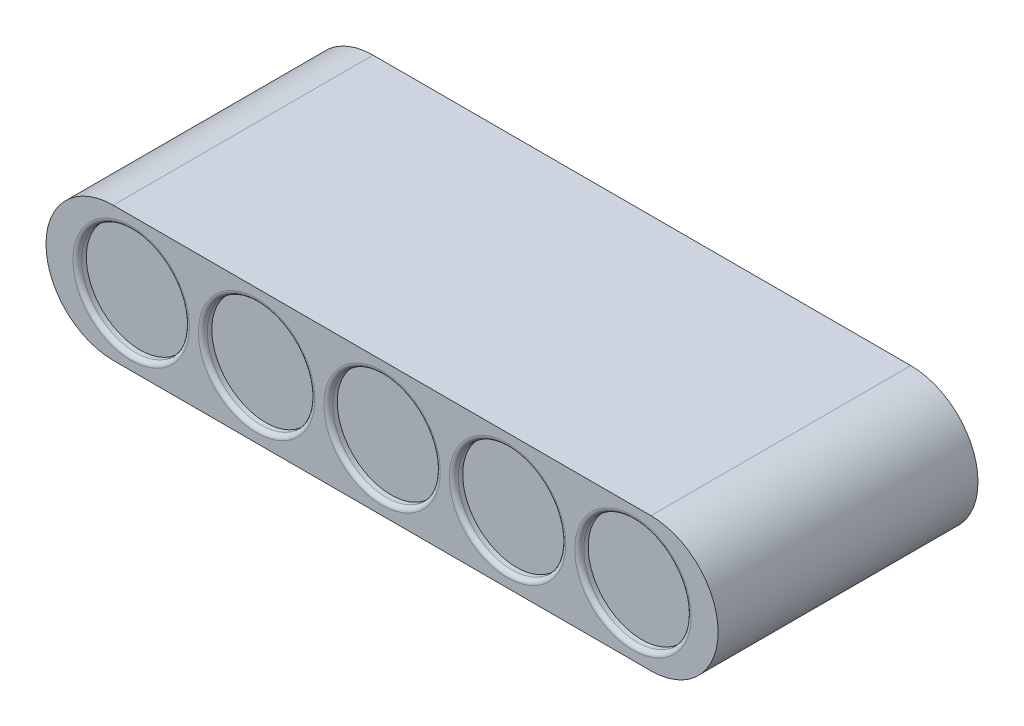
ISO-10303-21;
HEADER;
FILE_DESCRIPTION(('STEP AP214'),'2;1');
FILE_NAME('part.step','',(''),(''),'','','');
FILE_SCHEMA(('AUTOMOTIVE_DESIGN { 1 0 10303 214 1 1 1 1 }'));
ENDSEC;
DATA;
#1=APPLICATION_CONTEXT('core data for automotive mechanical design processes');
#2=APPLICATION_PROTOCOL_DEFINITION('international standard','automotive_design',2000,#1);
#3=PRODUCT_CONTEXT('',#1,'mechanical');
#4=PRODUCT('Part','Part','',(#3));
#5=PRODUCT_RELATED_PRODUCT_CATEGORY('part','',(#4));
#6=PRODUCT_DEFINITION_FORMATION('','',#4);
#7=PRODUCT_DEFINITION_CONTEXT('part definition',#1,'design');
#8=PRODUCT_DEFINITION('design','',#6,#7);
#9=PRODUCT_DEFINITION_SHAPE('','',#8);
#10=(LENGTH_UNIT() NAMED_UNIT(*) SI_UNIT(.MILLI.,.METRE.));
#11=(NAMED_UNIT(*) PLANE_ANGLE_UNIT() SI_UNIT($,.RADIAN.));
#12=(NAMED_UNIT(*) SI_UNIT($,.STERADIAN.) SOLID_ANGLE_UNIT());
#13=UNCERTAINTY_MEASURE_WITH_UNIT(LENGTH_MEASURE(1.E-05),#10,'distance_accuracy_value','');
#14=(GEOMETRIC_REPRESENTATION_CONTEXT(3) GLOBAL_UNCERTAINTY_ASSIGNED_CONTEXT((#13)) GLOBAL_UNIT_ASSIGNED_CONTEXT((#10,
#11,#12)) REPRESENTATION_CONTEXT('',''));
#15=CARTESIAN_POINT('',(0.,0.,0.));
#16=DIRECTION('',(0.,0.,1.));
#17=DIRECTION('',(1.,0.,0.));
#18=AXIS2_PLACEMENT_3D('',#15,#16,#17);
#19=CARTESIAN_POINT('',(0.,0.,58.));
#20=DIRECTION('',(0.,0.,-1.));
#21=DIRECTION('',(-1.,0.,0.));
#22=AXIS2_PLACEMENT_3D('',#19,#20,#21);
#23=CYLINDRICAL_SURFACE('',#22,15.);
#24=CARTESIAN_POINT('',(0.,0.,0.));
#25=DIRECTION('',(0.,0.,1.));
#26=DIRECTION('',(1.,0.,0.));
#27=AXIS2_PLACEMENT_3D('',#24,#25,#26);
#28=CIRCLE('',#27,15.);
#29=CARTESIAN_POINT('',(0.,15.,0.));
#30=VERTEX_POINT('',#29);
#31=CARTESIAN_POINT('',(0.,-15.,0.));
#32=VERTEX_POINT('',#31);
#33=EDGE_CURVE('E104',#30,#32,#28,.T.);
#34=ORIENTED_EDGE('',*,*,#33,.T.);
#35=DIRECTION('',(0.,0.,-1.));
#36=VECTOR('',#35,1.);
#37=CARTESIAN_POINT('',(0.,-15.,58.));
#38=LINE('',#37,#36);
#39=CARTESIAN_POINT('',(0.,-15.,58.));
#40=VERTEX_POINT('',#39);
#41=EDGE_CURVE('E96',#40,#32,#38,.T.);
#42=ORIENTED_EDGE('',*,*,#41,.F.);
#43=CARTESIAN_POINT('',(0.,0.,58.));
#44=DIRECTION('',(0.,0.,1.));
#45=DIRECTION('',(1.,0.,0.));
#46=AXIS2_PLACEMENT_3D('',#43,#44,#45);
#47=CIRCLE('',#46,15.);
#48=CARTESIAN_POINT('',(0.,15.,58.));
#49=VERTEX_POINT('',#48);
#50=EDGE_CURVE('E87',#49,#40,#47,.T.);
#51=ORIENTED_EDGE('',*,*,#50,.F.);
#52=DIRECTION('',(0.,0.,-1.));
#53=VECTOR('',#52,1.);
#54=CARTESIAN_POINT('',(0.,15.,58.));
#55=LINE('',#54,#53);
#56=EDGE_CURVE('E53',#49,#30,#55,.T.);
#57=ORIENTED_EDGE('',*,*,#56,.T.);
#58=EDGE_LOOP('',(#34,#42,#51,#57));
#59=FACE_BOUND('',#58,.T.);
#60=ADVANCED_FACE('F36',(#59),#23,.T.);
#61=CARTESIAN_POINT('',(0.,-15.,58.));
#62=DIRECTION('',(0.,1.,0.));
#63=DIRECTION('',(0.,0.,1.));
#64=AXIS2_PLACEMENT_3D('',#61,#62,#63);
#65=PLANE('',#64);
#66=DIRECTION('',(1.,0.,0.));
#67=VECTOR('',#66,1.);
#68=CARTESIAN_POINT('',(0.,-15.,0.));
#69=LINE('',#68,#67);
#70=CARTESIAN_POINT('',(120.,-15.,0.));
#71=VERTEX_POINT('',#70);
#72=EDGE_CURVE('E93',#32,#71,#69,.T.);
#73=ORIENTED_EDGE('',*,*,#72,.T.);
#74=DIRECTION('',(0.,0.,-1.));
#75=VECTOR('',#74,1.);
#76=CARTESIAN_POINT('',(120.,-15.,58.));
#77=LINE('',#76,#75);
#78=CARTESIAN_POINT('',(120.,-15.,58.));
#79=VERTEX_POINT('',#78);
#80=EDGE_CURVE('E91',#79,#71,#77,.T.);
#81=ORIENTED_EDGE('',*,*,#80,.F.);
#82=DIRECTION('',(1.,0.,0.));
#83=VECTOR('',#82,1.);
#84=CARTESIAN_POINT('',(0.,-15.,58.));
#85=LINE('',#84,#83);
#86=EDGE_CURVE('E79',#40,#79,#85,.T.);
#87=ORIENTED_EDGE('',*,*,#86,.F.);
#88=ORIENTED_EDGE('',*,*,#41,.T.);
#89=EDGE_LOOP('',(#73,#81,#87,#88));
#90=FACE_BOUND('',#89,.T.);
#91=ADVANCED_FACE('F92',(#90),#65,.F.);
#92=CARTESIAN_POINT('',(120.,0.,58.));
#93=DIRECTION('',(0.,0.,-1.));
#94=DIRECTION('',(-1.,0.,0.));
#95=AXIS2_PLACEMENT_3D('',#92,#93,#94);
#96=CYLINDRICAL_SURFACE('',#95,15.);
#97=CARTESIAN_POINT('',(120.,0.,0.));
#98=DIRECTION('',(0.,0.,1.));
#99=DIRECTION('',(1.,0.,0.));
#100=AXIS2_PLACEMENT_3D('',#97,#98,#99);
#101=CIRCLE('',#100,15.);
#102=CARTESIAN_POINT('',(120.,15.,0.));
#103=VERTEX_POINT('',#102);
#104=EDGE_CURVE('E108',#103,#71,#101,.F.);
#105=ORIENTED_EDGE('',*,*,#104,.F.);
#106=DIRECTION('',(0.,0.,-1.));
#107=VECTOR('',#106,1.);
#108=CARTESIAN_POINT('',(120.,15.,58.));
#109=LINE('',#108,#107);
#110=CARTESIAN_POINT('',(120.,15.,58.));
#111=VERTEX_POINT('',#110);
#112=EDGE_CURVE('E67',#111,#103,#109,.T.);
#113=ORIENTED_EDGE('',*,*,#112,.F.);
#114=CARTESIAN_POINT('',(120.,0.,58.));
#115=DIRECTION('',(0.,0.,1.));
#116=DIRECTION('',(1.,0.,0.));
#117=AXIS2_PLACEMENT_3D('',#114,#115,#116);
#118=CIRCLE('',#117,15.);
#119=EDGE_CURVE('E86',#111,#79,#118,.F.);
#120=ORIENTED_EDGE('',*,*,#119,.T.);
#121=ORIENTED_EDGE('',*,*,#80,.T.);
#122=EDGE_LOOP('',(#105,#113,#120,#121));
#123=FACE_BOUND('',#122,.T.);
#124=ADVANCED_FACE('F98',(#123),#96,.T.);
#125=CARTESIAN_POINT('',(0.,15.,58.));
#126=DIRECTION('',(0.,1.,0.));
#127=DIRECTION('',(0.,0.,1.));
#128=AXIS2_PLACEMENT_3D('',#125,#126,#127);
#129=PLANE('',#128);
#130=DIRECTION('',(1.,0.,0.));
#131=VECTOR('',#130,1.);
#132=CARTESIAN_POINT('',(0.,15.,0.));
#133=LINE('',#132,#131);
#134=EDGE_CURVE('E110',#30,#103,#133,.T.);
#135=ORIENTED_EDGE('',*,*,#134,.F.);
#136=ORIENTED_EDGE('',*,*,#56,.F.);
#137=DIRECTION('',(1.,0.,0.));
#138=VECTOR('',#137,1.);
#139=CARTESIAN_POINT('',(0.,15.,58.));
#140=LINE('',#139,#138);
#141=EDGE_CURVE('E99',#49,#111,#140,.T.);
#142=ORIENTED_EDGE('',*,*,#141,.T.);
#143=ORIENTED_EDGE('',*,*,#112,.T.);
#144=EDGE_LOOP('',(#135,#136,#142,#143));
#145=FACE_BOUND('',#144,.T.);
#146=ADVANCED_FACE('F228',(#145),#129,.T.);
#147=CARTESIAN_POINT('',(0.,0.,58.));
#148=DIRECTION('',(0.,0.,1.));
#149=DIRECTION('',(1.,0.,0.));
#150=AXIS2_PLACEMENT_3D('',#147,#148,#149);
#151=PLANE('',#150);
#152=CARTESIAN_POINT('',(116.,0.,58.));
#153=DIRECTION('',(0.,0.,1.));
#154=DIRECTION('',(1.,0.,0.));
#155=AXIS2_PLACEMENT_3D('',#152,#153,#154);
#156=CIRCLE('',#155,13.);
#157=CARTESIAN_POINT('',(129.,0.,58.));
#158=VERTEX_POINT('',#157);
#159=EDGE_CURVE('E131',#158,#158,#156,.F.);
#160=ORIENTED_EDGE('',*,*,#159,.T.);
#161=EDGE_LOOP('',(#160));
#162=FACE_BOUND('',#161,.T.);
#163=CARTESIAN_POINT('',(88.,0.,58.));
#164=DIRECTION('',(0.,0.,1.));
#165=DIRECTION('',(1.,0.,0.));
#166=AXIS2_PLACEMENT_3D('',#163,#164,#165);
#167=CIRCLE('',#166,13.);
#168=CARTESIAN_POINT('',(101.,0.,58.));
#169=VERTEX_POINT('',#168);
#170=EDGE_CURVE('E128',#169,#169,#167,.F.);
#171=ORIENTED_EDGE('',*,*,#170,.T.);
#172=EDGE_LOOP('',(#171));
#173=FACE_BOUND('',#172,.T.);
#174=CARTESIAN_POINT('',(60.,0.,58.));
#175=DIRECTION('',(0.,0.,1.));
#176=DIRECTION('',(1.,0.,0.));
#177=AXIS2_PLACEMENT_3D('',#174,#175,#176);
#178=CIRCLE('',#177,13.);
#179=CARTESIAN_POINT('',(73.,0.,58.));
#180=VERTEX_POINT('',#179);
#181=EDGE_CURVE('E125',#180,#180,#178,.F.);
#182=ORIENTED_EDGE('',*,*,#181,.T.);
#183=EDGE_LOOP('',(#182));
#184=FACE_BOUND('',#183,.T.);
#185=CARTESIAN_POINT('',(32.,-1.95522954975216E-13,58.));
#186=DIRECTION('',(0.,0.,1.));
#187=DIRECTION('',(1.,0.,0.));
#188=AXIS2_PLACEMENT_3D('',#185,#186,#187);
#189=CIRCLE('',#188,13.);
#190=CARTESIAN_POINT('',(45.,-1.95522954975216E-13,58.));
#191=VERTEX_POINT('',#190);
#192=EDGE_CURVE('E122',#191,#191,#189,.F.);
#193=ORIENTED_EDGE('',*,*,#192,.T.);
#194=EDGE_LOOP('',(#193));
#195=FACE_BOUND('',#194,.T.);
#196=CARTESIAN_POINT('',(4.,-3.91045909950431E-13,58.));
#197=DIRECTION('',(0.,0.,1.));
#198=DIRECTION('',(1.,0.,0.));
#199=AXIS2_PLACEMENT_3D('',#196,#197,#198);
#200=CIRCLE('',#199,13.);
#201=CARTESIAN_POINT('',(17.,-3.91045909950431E-13,58.));
#202=VERTEX_POINT('',#201);
#203=EDGE_CURVE('E119',#202,#202,#200,.F.);
#204=ORIENTED_EDGE('',*,*,#203,.T.);
#205=EDGE_LOOP('',(#204));
#206=FACE_BOUND('',#205,.T.);
#207=ORIENTED_EDGE('',*,*,#50,.T.);
#208=ORIENTED_EDGE('',*,*,#86,.T.);
#209=ORIENTED_EDGE('',*,*,#119,.F.);
#210=ORIENTED_EDGE('',*,*,#141,.F.);
#211=EDGE_LOOP('',(#207,#208,#209,#210));
#212=FACE_BOUND('',#211,.T.);
#213=ADVANCED_FACE('F83',(#162,#173,#184,#195,#206,#212),#151,.T.);
#214=CARTESIAN_POINT('',(0.,0.,0.));
#215=DIRECTION('',(0.,0.,1.));
#216=DIRECTION('',(1.,0.,0.));
#217=AXIS2_PLACEMENT_3D('',#214,#215,#216);
#218=PLANE('',#217);
#219=ORIENTED_EDGE('',*,*,#33,.F.);
#220=ORIENTED_EDGE('',*,*,#134,.T.);
#221=ORIENTED_EDGE('',*,*,#104,.T.);
#222=ORIENTED_EDGE('',*,*,#72,.F.);
#223=EDGE_LOOP('',(#219,#220,#221,#222));
#224=FACE_BOUND('',#223,.T.);
#225=ADVANCED_FACE('F224',(#224),#218,.F.);
#226=CARTESIAN_POINT('',(60.,0.,56.));
#227=DIRECTION('',(0.,0.,1.));
#228=DIRECTION('',(1.,0.,0.));
#229=AXIS2_PLACEMENT_3D('',#226,#227,#228);
#230=CYLINDRICAL_SURFACE('',#229,12.);
#231=CARTESIAN_POINT('',(60.,0.,57.));
#232=DIRECTION('',(0.,0.,1.));
#233=DIRECTION('',(1.,0.,0.));
#234=AXIS2_PLACEMENT_3D('',#231,#232,#233);
#235=CIRCLE('',#234,12.);
#236=CARTESIAN_POINT('',(72.,0.,57.));
#237=VERTEX_POINT('',#236);
#238=EDGE_CURVE('E137',#237,#237,#235,.T.);
#239=ORIENTED_EDGE('',*,*,#238,.T.);
#240=EDGE_LOOP('',(#239));
#241=FACE_BOUND('',#240,.T.);
#242=CARTESIAN_POINT('',(60.,0.,56.));
#243=DIRECTION('',(0.,0.,1.));
#244=DIRECTION('',(1.,0.,0.));
#245=AXIS2_PLACEMENT_3D('',#242,#243,#244);
#246=CIRCLE('',#245,12.);
#247=CARTESIAN_POINT('',(72.,0.,56.));
#248=VERTEX_POINT('',#247);
#249=EDGE_CURVE('E106',#248,#248,#246,.T.);
#250=ORIENTED_EDGE('',*,*,#249,.F.);
#251=EDGE_LOOP('',(#250));
#252=FACE_BOUND('',#251,.T.);
#253=ADVANCED_FACE('F220',(#241,#252),#230,.F.);
#254=CARTESIAN_POINT('',(60.,0.,56.));
#255=DIRECTION('',(0.,0.,1.));
#256=DIRECTION('',(1.,0.,0.));
#257=AXIS2_PLACEMENT_3D('',#254,#255,#256);
#258=PLANE('',#257);
#259=ORIENTED_EDGE('',*,*,#249,.T.);
#260=EDGE_LOOP('',(#259));
#261=FACE_BOUND('',#260,.T.);
#262=ADVANCED_FACE('F183',(#261),#258,.T.);
#263=CARTESIAN_POINT('',(88.,0.,56.));
#264=DIRECTION('',(0.,0.,1.));
#265=DIRECTION('',(1.,0.,0.));
#266=AXIS2_PLACEMENT_3D('',#263,#264,#265);
#267=CYLINDRICAL_SURFACE('',#266,12.);
#268=CARTESIAN_POINT('',(88.,0.,57.));
#269=DIRECTION('',(0.,0.,1.));
#270=DIRECTION('',(1.,0.,0.));
#271=AXIS2_PLACEMENT_3D('',#268,#269,#270);
#272=CIRCLE('',#271,12.);
#273=CARTESIAN_POINT('',(100.,0.,57.));
#274=VERTEX_POINT('',#273);
#275=EDGE_CURVE('E134',#274,#274,#272,.T.);
#276=ORIENTED_EDGE('',*,*,#275,.T.);
#277=EDGE_LOOP('',(#276));
#278=FACE_BOUND('',#277,.T.);
#279=CARTESIAN_POINT('',(88.,0.,56.));
#280=DIRECTION('',(0.,0.,1.));
#281=DIRECTION('',(1.,0.,0.));
#282=AXIS2_PLACEMENT_3D('',#279,#280,#281);
#283=CIRCLE('',#282,12.);
#284=CARTESIAN_POINT('',(100.,0.,56.));
#285=VERTEX_POINT('',#284);
#286=EDGE_CURVE('E187',#285,#285,#283,.T.);
#287=ORIENTED_EDGE('',*,*,#286,.F.);
#288=EDGE_LOOP('',(#287));
#289=FACE_BOUND('',#288,.T.);
#290=ADVANCED_FACE('F179',(#278,#289),#267,.F.);
#291=CARTESIAN_POINT('',(88.,0.,56.));
#292=DIRECTION('',(0.,0.,1.));
#293=DIRECTION('',(1.,0.,0.));
#294=AXIS2_PLACEMENT_3D('',#291,#292,#293);
#295=PLANE('',#294);
#296=ORIENTED_EDGE('',*,*,#286,.T.);
#297=EDGE_LOOP('',(#296));
#298=FACE_BOUND('',#297,.T.);
#299=ADVANCED_FACE('F182',(#298),#295,.T.);
#300=CARTESIAN_POINT('',(116.,0.,56.));
#301=DIRECTION('',(0.,0.,1.));
#302=DIRECTION('',(1.,0.,0.));
#303=AXIS2_PLACEMENT_3D('',#300,#301,#302);
#304=CYLINDRICAL_SURFACE('',#303,12.);
#305=CARTESIAN_POINT('',(116.,0.,57.));
#306=DIRECTION('',(0.,0.,1.));
#307=DIRECTION('',(1.,0.,0.));
#308=AXIS2_PLACEMENT_3D('',#305,#306,#307);
#309=CIRCLE('',#308,12.);
#310=CARTESIAN_POINT('',(128.,0.,57.));
#311=VERTEX_POINT('',#310);
#312=EDGE_CURVE('E116',#311,#311,#309,.T.);
#313=ORIENTED_EDGE('',*,*,#312,.T.);
#314=EDGE_LOOP('',(#313));
#315=FACE_BOUND('',#314,.T.);
#316=CARTESIAN_POINT('',(116.,0.,56.));
#317=DIRECTION('',(0.,0.,1.));
#318=DIRECTION('',(1.,0.,0.));
#319=AXIS2_PLACEMENT_3D('',#316,#317,#318);
#320=CIRCLE('',#319,12.);
#321=CARTESIAN_POINT('',(128.,0.,56.));
#322=VERTEX_POINT('',#321);
#323=EDGE_CURVE('E189',#322,#322,#320,.T.);
#324=ORIENTED_EDGE('',*,*,#323,.F.);
#325=EDGE_LOOP('',(#324));
#326=FACE_BOUND('',#325,.T.);
#327=ADVANCED_FACE('F271',(#315,#326),#304,.F.);
#328=CARTESIAN_POINT('',(116.,0.,56.));
#329=DIRECTION('',(0.,0.,1.));
#330=DIRECTION('',(1.,0.,0.));
#331=AXIS2_PLACEMENT_3D('',#328,#329,#330);
#332=PLANE('',#331);
#333=ORIENTED_EDGE('',*,*,#323,.T.);
#334=EDGE_LOOP('',(#333));
#335=FACE_BOUND('',#334,.T.);
#336=ADVANCED_FACE('F278',(#335),#332,.T.);
#337=CARTESIAN_POINT('',(32.,-1.95522954975216E-13,56.));
#338=DIRECTION('',(0.,0.,1.));
#339=DIRECTION('',(1.,0.,0.));
#340=AXIS2_PLACEMENT_3D('',#337,#338,#339);
#341=CYLINDRICAL_SURFACE('',#340,12.);
#342=CARTESIAN_POINT('',(32.,-1.95522954975216E-13,57.));
#343=DIRECTION('',(0.,0.,1.));
#344=DIRECTION('',(1.,0.,0.));
#345=AXIS2_PLACEMENT_3D('',#342,#343,#344);
#346=CIRCLE('',#345,12.);
#347=CARTESIAN_POINT('',(44.,-1.95522954975216E-13,57.));
#348=VERTEX_POINT('',#347);
#349=EDGE_CURVE('E45',#348,#348,#346,.T.);
#350=ORIENTED_EDGE('',*,*,#349,.T.);
#351=EDGE_LOOP('',(#350));
#352=FACE_BOUND('',#351,.T.);
#353=CARTESIAN_POINT('',(32.,-1.95522954975216E-13,56.));
#354=DIRECTION('',(0.,0.,1.));
#355=DIRECTION('',(1.,0.,0.));
#356=AXIS2_PLACEMENT_3D('',#353,#354,#355);
#357=CIRCLE('',#356,12.);
#358=CARTESIAN_POINT('',(44.,-1.95522954975216E-13,56.));
#359=VERTEX_POINT('',#358);
#360=EDGE_CURVE('E194',#359,#359,#357,.T.);
#361=ORIENTED_EDGE('',*,*,#360,.F.);
#362=EDGE_LOOP('',(#361));
#363=FACE_BOUND('',#362,.T.);
#364=ADVANCED_FACE('F142',(#352,#363),#341,.F.);
#365=CARTESIAN_POINT('',(32.,-1.95522954975216E-13,56.));
#366=DIRECTION('',(0.,0.,1.));
#367=DIRECTION('',(1.,0.,0.));
#368=AXIS2_PLACEMENT_3D('',#365,#366,#367);
#369=PLANE('',#368);
#370=ORIENTED_EDGE('',*,*,#360,.T.);
#371=EDGE_LOOP('',(#370));
#372=FACE_BOUND('',#371,.T.);
#373=ADVANCED_FACE('F206',(#372),#369,.T.);
#374=CARTESIAN_POINT('',(4.,-3.91045909950431E-13,56.));
#375=DIRECTION('',(0.,0.,1.));
#376=DIRECTION('',(1.,0.,0.));
#377=AXIS2_PLACEMENT_3D('',#374,#375,#376);
#378=CYLINDRICAL_SURFACE('',#377,12.);
#379=CARTESIAN_POINT('',(4.,-3.91045909950431E-13,57.));
#380=DIRECTION('',(0.,0.,1.));
#381=DIRECTION('',(1.,0.,0.));
#382=AXIS2_PLACEMENT_3D('',#379,#380,#381);
#383=CIRCLE('',#382,12.);
#384=CARTESIAN_POINT('',(16.,-3.91045909950431E-13,57.));
#385=VERTEX_POINT('',#384);
#386=EDGE_CURVE('E11',#385,#385,#383,.T.);
#387=ORIENTED_EDGE('',*,*,#386,.T.);
#388=EDGE_LOOP('',(#387));
#389=FACE_BOUND('',#388,.T.);
#390=CARTESIAN_POINT('',(4.,-3.91045909950431E-13,56.));
#391=DIRECTION('',(0.,0.,1.));
#392=DIRECTION('',(1.,0.,0.));
#393=AXIS2_PLACEMENT_3D('',#390,#391,#392);
#394=CIRCLE('',#393,12.);
#395=CARTESIAN_POINT('',(16.,-3.91045909950431E-13,56.));
#396=VERTEX_POINT('',#395);
#397=EDGE_CURVE('E199',#396,#396,#394,.T.);
#398=ORIENTED_EDGE('',*,*,#397,.F.);
#399=EDGE_LOOP('',(#398));
#400=FACE_BOUND('',#399,.T.);
#401=ADVANCED_FACE('F204',(#389,#400),#378,.F.);
#402=CARTESIAN_POINT('',(4.,-3.91045909950431E-13,56.));
#403=DIRECTION('',(0.,0.,1.));
#404=DIRECTION('',(1.,0.,0.));
#405=AXIS2_PLACEMENT_3D('',#402,#403,#404);
#406=PLANE('',#405);
#407=ORIENTED_EDGE('',*,*,#397,.T.);
#408=EDGE_LOOP('',(#407));
#409=FACE_BOUND('',#408,.T.);
#410=ADVANCED_FACE('F169',(#409),#406,.T.);
#411=CARTESIAN_POINT('',(116.,0.,57.));
#412=DIRECTION('',(0.,0.,1.));
#413=DIRECTION('',(1.,0.,0.));
#414=AXIS2_PLACEMENT_3D('',#411,#412,#413);
#415=TOROIDAL_SURFACE('',#414,13.,1.);
#416=ORIENTED_EDGE('',*,*,#159,.F.);
#417=EDGE_LOOP('',(#416));
#418=FACE_BOUND('',#417,.T.);
#419=ORIENTED_EDGE('',*,*,#312,.F.);
#420=EDGE_LOOP('',(#419));
#421=FACE_BOUND('',#420,.T.);
#422=ADVANCED_FACE('F166',(#418,#421),#415,.T.);
#423=CARTESIAN_POINT('',(88.,0.,57.));
#424=DIRECTION('',(0.,0.,1.));
#425=DIRECTION('',(1.,0.,0.));
#426=AXIS2_PLACEMENT_3D('',#423,#424,#425);
#427=TOROIDAL_SURFACE('',#426,13.,1.);
#428=ORIENTED_EDGE('',*,*,#170,.F.);
#429=EDGE_LOOP('',(#428));
#430=FACE_BOUND('',#429,.T.);
#431=ORIENTED_EDGE('',*,*,#275,.F.);
#432=EDGE_LOOP('',(#431));
#433=FACE_BOUND('',#432,.T.);
#434=ADVANCED_FACE('F154',(#430,#433),#427,.T.);
#435=CARTESIAN_POINT('',(60.,0.,57.));
#436=DIRECTION('',(0.,0.,1.));
#437=DIRECTION('',(1.,0.,0.));
#438=AXIS2_PLACEMENT_3D('',#435,#436,#437);
#439=TOROIDAL_SURFACE('',#438,13.,1.);
#440=ORIENTED_EDGE('',*,*,#181,.F.);
#441=EDGE_LOOP('',(#440));
#442=FACE_BOUND('',#441,.T.);
#443=ORIENTED_EDGE('',*,*,#238,.F.);
#444=EDGE_LOOP('',(#443));
#445=FACE_BOUND('',#444,.T.);
#446=ADVANCED_FACE('F147',(#442,#445),#439,.T.);
#447=CARTESIAN_POINT('',(32.,-1.95522954975216E-13,57.));
#448=DIRECTION('',(0.,0.,1.));
#449=DIRECTION('',(1.,0.,0.));
#450=AXIS2_PLACEMENT_3D('',#447,#448,#449);
#451=TOROIDAL_SURFACE('',#450,13.,1.);
#452=ORIENTED_EDGE('',*,*,#192,.F.);
#453=EDGE_LOOP('',(#452));
#454=FACE_BOUND('',#453,.T.);
#455=ORIENTED_EDGE('',*,*,#349,.F.);
#456=EDGE_LOOP('',(#455));
#457=FACE_BOUND('',#456,.T.);
#458=ADVANCED_FACE('F145',(#454,#457),#451,.T.);
#459=CARTESIAN_POINT('',(4.,-3.91045909950431E-13,57.));
#460=DIRECTION('',(0.,0.,1.));
#461=DIRECTION('',(1.,0.,0.));
#462=AXIS2_PLACEMENT_3D('',#459,#460,#461);
#463=TOROIDAL_SURFACE('',#462,13.,1.);
#464=ORIENTED_EDGE('',*,*,#203,.F.);
#465=EDGE_LOOP('',(#464));
#466=FACE_BOUND('',#465,.T.);
#467=ORIENTED_EDGE('',*,*,#386,.F.);
#468=EDGE_LOOP('',(#467));
#469=FACE_BOUND('',#468,.T.);
#470=ADVANCED_FACE('F38',(#466,#469),#463,.T.);
#471=CLOSED_SHELL('',(#60,#91,#124,#146,#213,#225,#253,#262,#290,#299,#327,#336,#364,#373,#401,
#410,#422,#434,#446,#458,#470));
#472=MANIFOLD_SOLID_BREP('B2',#471);
#473=ADVANCED_BREP_SHAPE_REPRESENTATION('',(#18,#472),#14);
#474=SHAPE_DEFINITION_REPRESENTATION(#9,#473);
ENDSEC;
END-ISO-10303-21;
